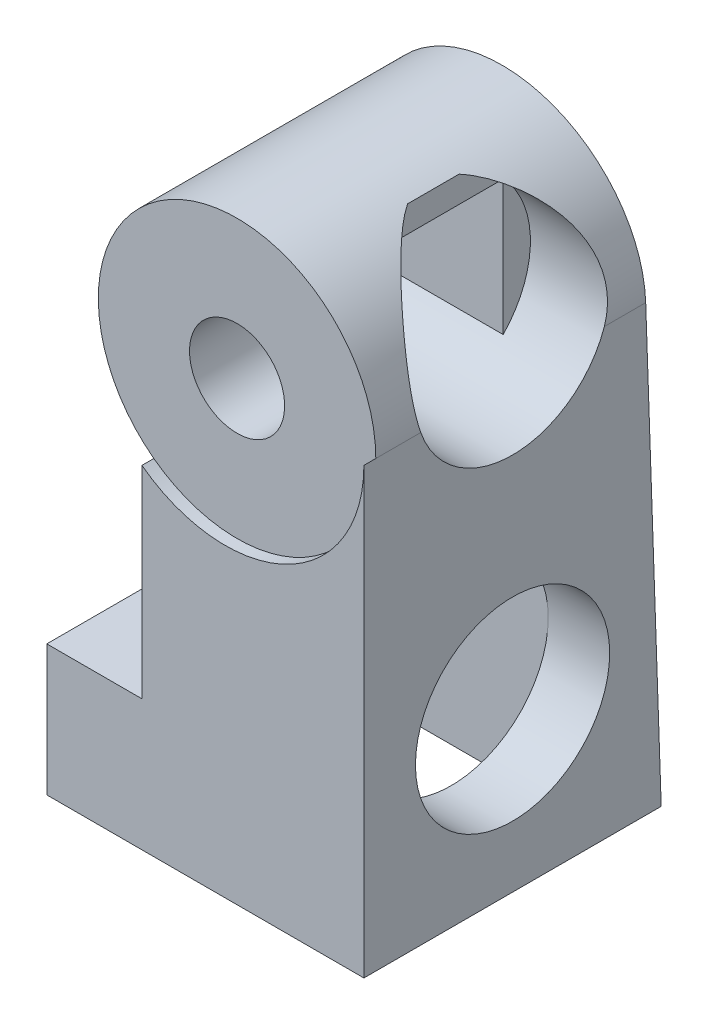
ISO-10303-21;
HEADER;
FILE_DESCRIPTION(('STEP AP214'),'2;1');
FILE_NAME('part.step','',(''),(''),'','','');
FILE_SCHEMA(('AUTOMOTIVE_DESIGN { 1 0 10303 214 1 1 1 1 }'));
ENDSEC;
DATA;
#1=APPLICATION_CONTEXT('core data for automotive mechanical design processes');
#2=APPLICATION_PROTOCOL_DEFINITION('international standard','automotive_design',2000,#1);
#3=PRODUCT_CONTEXT('',#1,'mechanical');
#4=PRODUCT('Part','Part','',(#3));
#5=PRODUCT_RELATED_PRODUCT_CATEGORY('part','',(#4));
#6=PRODUCT_DEFINITION_FORMATION('','',#4);
#7=PRODUCT_DEFINITION_CONTEXT('part definition',#1,'design');
#8=PRODUCT_DEFINITION('design','',#6,#7);
#9=PRODUCT_DEFINITION_SHAPE('','',#8);
#10=(LENGTH_UNIT() NAMED_UNIT(*) SI_UNIT(.MILLI.,.METRE.));
#11=(NAMED_UNIT(*) PLANE_ANGLE_UNIT() SI_UNIT($,.RADIAN.));
#12=(NAMED_UNIT(*) SI_UNIT($,.STERADIAN.) SOLID_ANGLE_UNIT());
#13=UNCERTAINTY_MEASURE_WITH_UNIT(LENGTH_MEASURE(1.E-05),#10,'distance_accuracy_value','');
#14=(GEOMETRIC_REPRESENTATION_CONTEXT(3) GLOBAL_UNCERTAINTY_ASSIGNED_CONTEXT((#13)) GLOBAL_UNIT_ASSIGNED_CONTEXT((#10,
#11,#12)) REPRESENTATION_CONTEXT('',''));
#15=CARTESIAN_POINT('',(0.,0.,0.));
#16=DIRECTION('',(0.,0.,1.));
#17=DIRECTION('',(1.,0.,0.));
#18=AXIS2_PLACEMENT_3D('',#15,#16,#17);
#19=CARTESIAN_POINT('',(6.,12.,-3.75));
#20=DIRECTION('',(1.,0.,0.));
#21=DIRECTION('',(0.,0.,1.));
#22=AXIS2_PLACEMENT_3D('',#19,#20,#21);
#23=PLANE('',#22);
#24=DIRECTION('',(0.,1.,0.));
#25=VECTOR('',#24,1.);
#26=CARTESIAN_POINT('',(6.,13.7,-2.7));
#27=LINE('',#26,#25);
#28=CARTESIAN_POINT('',(6.,9.78640563788213,-2.7));
#29=VERTEX_POINT('',#28);
#30=CARTESIAN_POINT('',(6.,13.7,-2.7));
#31=VERTEX_POINT('',#30);
#32=EDGE_CURVE('E192',#29,#31,#27,.T.);
#33=ORIENTED_EDGE('',*,*,#32,.T.);
#34=DIRECTION('',(0.,0.,-1.));
#35=VECTOR('',#34,1.);
#36=CARTESIAN_POINT('',(6.,13.7,-5.51422787643774));
#37=LINE('',#36,#35);
#38=CARTESIAN_POINT('',(6.,13.7,-5.51422787643774));
#39=VERTEX_POINT('',#38);
#40=EDGE_CURVE('E178',#31,#39,#37,.T.);
#41=ORIENTED_EDGE('',*,*,#40,.T.);
#42=CARTESIAN_POINT('',(6.,12.,-3.75));
#43=DIRECTION('',(-1.,0.,0.));
#44=DIRECTION('',(0.,0.,1.));
#45=AXIS2_PLACEMENT_3D('',#42,#43,#44);
#46=CIRCLE('',#45,2.45);
#47=CARTESIAN_POINT('',(6.,14.3622776601684,-4.39972629334929));
#48=VERTEX_POINT('',#47);
#49=EDGE_CURVE('E198',#48,#39,#46,.T.);
#50=ORIENTED_EDGE('',*,*,#49,.F.);
#51=DIRECTION('',(0.,0.,1.));
#52=VECTOR('',#51,1.);
#53=CARTESIAN_POINT('',(6.,14.3622776601684,-7.5));
#54=LINE('',#53,#52);
#55=CARTESIAN_POINT('',(6.,14.3622776601684,-3.10027370665071));
#56=VERTEX_POINT('',#55);
#57=EDGE_CURVE('E527',#56,#48,#54,.F.);
#58=ORIENTED_EDGE('',*,*,#57,.F.);
#59=EDGE_CURVE('E199',#29,#56,#46,.T.);
#60=ORIENTED_EDGE('',*,*,#59,.F.);
#61=EDGE_LOOP('',(#33,#41,#50,#58,#60));
#62=FACE_BOUND('',#61,.T.);
#63=ADVANCED_FACE('F36',(#62),#23,.T.);
#64=CARTESIAN_POINT('',(0.,0.,0.));
#65=DIRECTION('',(0.,0.,-1.));
#66=DIRECTION('',(1.,0.,0.));
#67=AXIS2_PLACEMENT_3D('',#64,#65,#66);
#68=PLANE('',#67);
#69=CARTESIAN_POINT('',(4.5,11.2,0.));
#70=DIRECTION('',(0.,0.,1.));
#71=DIRECTION('',(1.,0.,0.));
#72=AXIS2_PLACEMENT_3D('',#69,#70,#71);
#73=CIRCLE('',#72,3.5);
#74=CARTESIAN_POINT('',(2.4,8.4,0.));
#75=VERTEX_POINT('',#74);
#76=CARTESIAN_POINT('',(8.,11.2,0.));
#77=VERTEX_POINT('',#76);
#78=EDGE_CURVE('E228',#75,#77,#73,.T.);
#79=ORIENTED_EDGE('',*,*,#78,.F.);
#80=DIRECTION('',(0.,-1.,0.));
#81=VECTOR('',#80,1.);
#82=CARTESIAN_POINT('',(2.4,0.,0.));
#83=LINE('',#82,#81);
#84=CARTESIAN_POINT('',(2.4,3.3,0.));
#85=VERTEX_POINT('',#84);
#86=EDGE_CURVE('E552',#75,#85,#83,.T.);
#87=ORIENTED_EDGE('',*,*,#86,.T.);
#88=DIRECTION('',(-1.,0.,0.));
#89=VECTOR('',#88,1.);
#90=CARTESIAN_POINT('',(0.,3.3,0.));
#91=LINE('',#90,#89);
#92=CARTESIAN_POINT('',(0.,3.3,0.));
#93=VERTEX_POINT('',#92);
#94=EDGE_CURVE('E576',#85,#93,#91,.T.);
#95=ORIENTED_EDGE('',*,*,#94,.T.);
#96=DIRECTION('',(0.,-1.,0.));
#97=VECTOR('',#96,1.);
#98=CARTESIAN_POINT('',(0.,0.,0.));
#99=LINE('',#98,#97);
#100=CARTESIAN_POINT('',(0.,0.,0.));
#101=VERTEX_POINT('',#100);
#102=EDGE_CURVE('E578',#93,#101,#99,.T.);
#103=ORIENTED_EDGE('',*,*,#102,.T.);
#104=DIRECTION('',(1.,0.,0.));
#105=VECTOR('',#104,1.);
#106=CARTESIAN_POINT('',(0.,0.,0.));
#107=LINE('',#106,#105);
#108=CARTESIAN_POINT('',(8.,0.,0.));
#109=VERTEX_POINT('',#108);
#110=EDGE_CURVE('E567',#101,#109,#107,.T.);
#111=ORIENTED_EDGE('',*,*,#110,.T.);
#112=DIRECTION('',(0.,1.,0.));
#113=VECTOR('',#112,1.);
#114=CARTESIAN_POINT('',(8.,0.,0.));
#115=LINE('',#114,#113);
#116=EDGE_CURVE('E550',#109,#77,#115,.T.);
#117=ORIENTED_EDGE('',*,*,#116,.T.);
#118=EDGE_LOOP('',(#79,#87,#95,#103,#111,#117));
#119=FACE_BOUND('',#118,.T.);
#120=ADVANCED_FACE('F290',(#119),#68,.F.);
#121=CARTESIAN_POINT('',(6.45,2.5,-6.2));
#122=DIRECTION('',(1.,0.,0.));
#123=DIRECTION('',(0.,0.,1.));
#124=AXIS2_PLACEMENT_3D('',#121,#122,#123);
#125=PLANE('',#124);
#126=DIRECTION('',(0.,-1.,0.));
#127=VECTOR('',#126,1.);
#128=CARTESIAN_POINT('',(6.45,2.5,-1.3));
#129=LINE('',#128,#127);
#130=CARTESIAN_POINT('',(6.45,8.8,-1.3));
#131=VERTEX_POINT('',#130);
#132=CARTESIAN_POINT('',(6.45,4.,-1.3));
#133=VERTEX_POINT('',#132);
#134=EDGE_CURVE('E611',#131,#133,#129,.T.);
#135=ORIENTED_EDGE('',*,*,#134,.F.);
#136=DIRECTION('',(0.,0.,-1.));
#137=VECTOR('',#136,1.);
#138=CARTESIAN_POINT('',(6.45,8.8,-6.2));
#139=LINE('',#138,#137);
#140=CARTESIAN_POINT('',(6.45,8.8,-6.2));
#141=VERTEX_POINT('',#140);
#142=EDGE_CURVE('E497',#131,#141,#139,.T.);
#143=ORIENTED_EDGE('',*,*,#142,.T.);
#144=DIRECTION('',(0.,-1.,0.));
#145=VECTOR('',#144,1.);
#146=CARTESIAN_POINT('',(6.45,2.5,-6.2));
#147=LINE('',#146,#145);
#148=CARTESIAN_POINT('',(6.45,4.,-6.2));
#149=VERTEX_POINT('',#148);
#150=EDGE_CURVE('E608',#141,#149,#147,.T.);
#151=ORIENTED_EDGE('',*,*,#150,.T.);
#152=CARTESIAN_POINT('',(6.45,4.,-3.75));
#153=DIRECTION('',(-1.,0.,0.));
#154=DIRECTION('',(0.,0.,1.));
#155=AXIS2_PLACEMENT_3D('',#152,#153,#154);
#156=CIRCLE('',#155,2.45);
#157=EDGE_CURVE('E491',#133,#149,#156,.T.);
#158=ORIENTED_EDGE('',*,*,#157,.F.);
#159=EDGE_LOOP('',(#135,#143,#151,#158));
#160=FACE_BOUND('',#159,.T.);
#161=ADVANCED_FACE('F273',(#160),#125,.F.);
#162=CARTESIAN_POINT('',(2.4,0.,-7.5));
#163=DIRECTION('',(1.,0.,0.));
#164=DIRECTION('',(0.,1.,0.));
#165=AXIS2_PLACEMENT_3D('',#162,#163,#164);
#166=PLANE('',#165);
#167=ORIENTED_EDGE('',*,*,#86,.F.);
#168=DIRECTION('',(0.,0.,1.));
#169=VECTOR('',#168,1.);
#170=CARTESIAN_POINT('',(2.4,8.4,-7.5));
#171=LINE('',#170,#169);
#172=CARTESIAN_POINT('',(2.4,8.4,-0.299999999999998));
#173=VERTEX_POINT('',#172);
#174=EDGE_CURVE('E528',#173,#75,#171,.T.);
#175=ORIENTED_EDGE('',*,*,#174,.F.);
#176=CARTESIAN_POINT('',(2.4,8.4,-7.20666553626932));
#177=VERTEX_POINT('',#176);
#178=EDGE_CURVE('E524',#177,#173,#171,.T.);
#179=ORIENTED_EDGE('',*,*,#178,.F.);
#180=DIRECTION('',(0.,-0.999390827019096,-0.034899496702501));
#181=VECTOR('',#180,1.);
#182=CARTESIAN_POINT('',(2.4,0.,-7.5));
#183=LINE('',#182,#181);
#184=CARTESIAN_POINT('',(2.4,3.3,-7.38476146067723));
#185=VERTEX_POINT('',#184);
#186=EDGE_CURVE('E547',#177,#185,#183,.T.);
#187=ORIENTED_EDGE('',*,*,#186,.T.);
#188=DIRECTION('',(0.,0.,1.));
#189=VECTOR('',#188,1.);
#190=CARTESIAN_POINT('',(2.4,3.3,-7.5));
#191=LINE('',#190,#189);
#192=EDGE_CURVE('E572',#185,#85,#191,.T.);
#193=ORIENTED_EDGE('',*,*,#192,.T.);
#194=EDGE_LOOP('',(#167,#175,#179,#187,#193));
#195=FACE_BOUND('',#194,.T.);
#196=ADVANCED_FACE('F268',(#195),#166,.F.);
#197=CARTESIAN_POINT('',(0.,3.3,-7.5));
#198=DIRECTION('',(0.,-1.,0.));
#199=DIRECTION('',(1.,0.,0.));
#200=AXIS2_PLACEMENT_3D('',#197,#198,#199);
#201=PLANE('',#200);
#202=ORIENTED_EDGE('',*,*,#94,.F.);
#203=ORIENTED_EDGE('',*,*,#192,.F.);
#204=DIRECTION('',(-1.,0.,0.));
#205=VECTOR('',#204,1.);
#206=CARTESIAN_POINT('',(0.,3.3,-7.38476146067723));
#207=LINE('',#206,#205);
#208=CARTESIAN_POINT('',(0.,3.3,-7.38476146067723));
#209=VERTEX_POINT('',#208);
#210=EDGE_CURVE('E544',#185,#209,#207,.T.);
#211=ORIENTED_EDGE('',*,*,#210,.T.);
#212=DIRECTION('',(0.,0.,1.));
#213=VECTOR('',#212,1.);
#214=CARTESIAN_POINT('',(0.,3.3,-7.5));
#215=LINE('',#214,#213);
#216=EDGE_CURVE('E589',#209,#93,#215,.T.);
#217=ORIENTED_EDGE('',*,*,#216,.T.);
#218=EDGE_LOOP('',(#202,#203,#211,#217));
#219=FACE_BOUND('',#218,.T.);
#220=ADVANCED_FACE('F272',(#219),#201,.F.);
#221=CARTESIAN_POINT('',(0.,0.,-7.5));
#222=DIRECTION('',(1.,0.,0.));
#223=DIRECTION('',(0.,0.,1.));
#224=AXIS2_PLACEMENT_3D('',#221,#222,#223);
#225=PLANE('',#224);
#226=ORIENTED_EDGE('',*,*,#102,.F.);
#227=ORIENTED_EDGE('',*,*,#216,.F.);
#228=DIRECTION('',(0.,-0.999390827019096,-0.034899496702501));
#229=VECTOR('',#228,1.);
#230=CARTESIAN_POINT('',(0.,0.,-7.5));
#231=LINE('',#230,#229);
#232=CARTESIAN_POINT('',(0.,0.,-7.5));
#233=VERTEX_POINT('',#232);
#234=EDGE_CURVE('E541',#209,#233,#231,.T.);
#235=ORIENTED_EDGE('',*,*,#234,.T.);
#236=DIRECTION('',(0.,0.,1.));
#237=VECTOR('',#236,1.);
#238=CARTESIAN_POINT('',(0.,0.,-7.5));
#239=LINE('',#238,#237);
#240=EDGE_CURVE('E587',#233,#101,#239,.T.);
#241=ORIENTED_EDGE('',*,*,#240,.T.);
#242=EDGE_LOOP('',(#226,#227,#235,#241));
#243=FACE_BOUND('',#242,.T.);
#244=ADVANCED_FACE('F277',(#243),#225,.F.);
#245=CARTESIAN_POINT('',(0.,0.,-7.5));
#246=DIRECTION('',(0.,1.,0.));
#247=DIRECTION('',(0.,0.,-1.));
#248=AXIS2_PLACEMENT_3D('',#245,#246,#247);
#249=PLANE('',#248);
#250=DIRECTION('',(1.,0.,0.));
#251=VECTOR('',#250,1.);
#252=CARTESIAN_POINT('',(1.55,0.,-1.3));
#253=LINE('',#252,#251);
#254=CARTESIAN_POINT('',(1.55,0.,-1.3));
#255=VERTEX_POINT('',#254);
#256=CARTESIAN_POINT('',(6.45,0.,-1.3));
#257=VERTEX_POINT('',#256);
#258=EDGE_CURVE('E598',#255,#257,#253,.T.);
#259=ORIENTED_EDGE('',*,*,#258,.T.);
#260=DIRECTION('',(0.,0.,-1.));
#261=VECTOR('',#260,1.);
#262=CARTESIAN_POINT('',(6.45,0.,-6.2));
#263=LINE('',#262,#261);
#264=CARTESIAN_POINT('',(6.45,0.,-6.2));
#265=VERTEX_POINT('',#264);
#266=EDGE_CURVE('E601',#257,#265,#263,.T.);
#267=ORIENTED_EDGE('',*,*,#266,.T.);
#268=DIRECTION('',(-1.,0.,0.));
#269=VECTOR('',#268,1.);
#270=CARTESIAN_POINT('',(1.55,0.,-6.2));
#271=LINE('',#270,#269);
#272=CARTESIAN_POINT('',(1.55,0.,-6.2));
#273=VERTEX_POINT('',#272);
#274=EDGE_CURVE('E604',#265,#273,#271,.T.);
#275=ORIENTED_EDGE('',*,*,#274,.T.);
#276=DIRECTION('',(0.,0.,1.));
#277=VECTOR('',#276,1.);
#278=CARTESIAN_POINT('',(1.55,0.,-6.2));
#279=LINE('',#278,#277);
#280=EDGE_CURVE('E517',#273,#255,#279,.T.);
#281=ORIENTED_EDGE('',*,*,#280,.T.);
#282=EDGE_LOOP('',(#259,#267,#275,#281));
#283=FACE_BOUND('',#282,.T.);
#284=ORIENTED_EDGE('',*,*,#110,.F.);
#285=ORIENTED_EDGE('',*,*,#240,.F.);
#286=DIRECTION('',(1.,0.,0.));
#287=VECTOR('',#286,1.);
#288=CARTESIAN_POINT('',(0.,0.,-7.5));
#289=LINE('',#288,#287);
#290=CARTESIAN_POINT('',(8.,0.,-7.5));
#291=VERTEX_POINT('',#290);
#292=EDGE_CURVE('E538',#233,#291,#289,.T.);
#293=ORIENTED_EDGE('',*,*,#292,.T.);
#294=DIRECTION('',(0.,0.,1.));
#295=VECTOR('',#294,1.);
#296=CARTESIAN_POINT('',(8.,0.,-7.5));
#297=LINE('',#296,#295);
#298=EDGE_CURVE('E532',#291,#109,#297,.T.);
#299=ORIENTED_EDGE('',*,*,#298,.T.);
#300=EDGE_LOOP('',(#284,#285,#293,#299));
#301=FACE_BOUND('',#300,.T.);
#302=ADVANCED_FACE('F281',(#283,#301),#249,.F.);
#303=CARTESIAN_POINT('',(8.,0.,-7.5));
#304=DIRECTION('',(-1.,0.,0.));
#305=DIRECTION('',(0.,0.,-1.));
#306=AXIS2_PLACEMENT_3D('',#303,#304,#305);
#307=PLANE('',#306);
#308=CARTESIAN_POINT('',(8.,4.,-3.75));
#309=DIRECTION('',(-1.,0.,0.));
#310=DIRECTION('',(0.,0.,1.));
#311=AXIS2_PLACEMENT_3D('',#308,#309,#310);
#312=CIRCLE('',#311,2.45);
#313=CARTESIAN_POINT('',(8.,4.,-1.3));
#314=VERTEX_POINT('',#313);
#315=EDGE_CURVE('E207',#314,#314,#312,.T.);
#316=ORIENTED_EDGE('',*,*,#315,.T.);
#317=EDGE_LOOP('',(#316));
#318=FACE_BOUND('',#317,.T.);
#319=DIRECTION('',(0.,0.,1.));
#320=VECTOR('',#319,1.);
#321=CARTESIAN_POINT('',(8.,11.2,-7.5));
#322=LINE('',#321,#320);
#323=CARTESIAN_POINT('',(8.,11.2,-1.43429276461812));
#324=VERTEX_POINT('',#323);
#325=CARTESIAN_POINT('',(8.,11.2,-0.299999999999998));
#326=VERTEX_POINT('',#325);
#327=EDGE_CURVE('E533',#324,#326,#322,.T.);
#328=ORIENTED_EDGE('',*,*,#327,.T.);
#329=EDGE_CURVE('E534',#326,#77,#322,.T.);
#330=ORIENTED_EDGE('',*,*,#329,.T.);
#331=ORIENTED_EDGE('',*,*,#116,.F.);
#332=ORIENTED_EDGE('',*,*,#298,.F.);
#333=DIRECTION('',(0.,0.999390827019096,0.034899496702501));
#334=VECTOR('',#333,1.);
#335=CARTESIAN_POINT('',(8.,0.,-7.5));
#336=LINE('',#335,#334);
#337=CARTESIAN_POINT('',(8.,11.2,-7.10888738169242));
#338=VERTEX_POINT('',#337);
#339=EDGE_CURVE('E535',#291,#338,#336,.T.);
#340=ORIENTED_EDGE('',*,*,#339,.T.);
#341=CARTESIAN_POINT('',(8.,11.2,-6.06570723538188));
#342=VERTEX_POINT('',#341);
#343=EDGE_CURVE('E529',#338,#342,#322,.T.);
#344=ORIENTED_EDGE('',*,*,#343,.T.);
#345=CARTESIAN_POINT('',(8.,12.,-3.75));
#346=DIRECTION('',(-1.,0.,0.));
#347=DIRECTION('',(0.,0.,1.));
#348=AXIS2_PLACEMENT_3D('',#345,#346,#347);
#349=CIRCLE('',#348,2.45);
#350=EDGE_CURVE('E482',#342,#324,#349,.T.);
#351=ORIENTED_EDGE('',*,*,#350,.T.);
#352=EDGE_LOOP('',(#328,#330,#331,#332,#340,#344,#351));
#353=FACE_BOUND('',#352,.T.);
#354=ADVANCED_FACE('F285',(#318,#353),#307,.F.);
#355=CARTESIAN_POINT('',(0.,0.,-7.5));
#356=DIRECTION('',(0.,0.034899496702501,-0.999390827019096));
#357=DIRECTION('',(0.,-0.999390827019096,-0.034899496702501));
#358=AXIS2_PLACEMENT_3D('',#355,#356,#357);
#359=PLANE('',#358);
#360=ORIENTED_EDGE('',*,*,#339,.F.);
#361=ORIENTED_EDGE('',*,*,#292,.F.);
#362=ORIENTED_EDGE('',*,*,#234,.F.);
#363=ORIENTED_EDGE('',*,*,#210,.F.);
#364=ORIENTED_EDGE('',*,*,#186,.F.);
#365=CARTESIAN_POINT('',(4.5,11.2,-7.10888738169242));
#366=DIRECTION('',(0.,-0.034899496702501,0.999390827019096));
#367=DIRECTION('',(0.,0.999390827019096,0.034899496702501));
#368=AXIS2_PLACEMENT_3D('',#365,#366,#367);
#369=ELLIPSE('',#368,3.50213340504588,3.5);
#370=EDGE_CURVE('E551',#338,#177,#369,.T.);
#371=ORIENTED_EDGE('',*,*,#370,.F.);
#372=EDGE_LOOP('',(#360,#361,#362,#363,#364,#371));
#373=FACE_BOUND('',#372,.T.);
#374=ADVANCED_FACE('F38',(#373),#359,.T.);
#375=CARTESIAN_POINT('',(4.5,11.2,-7.5));
#376=DIRECTION('',(0.,0.,1.));
#377=DIRECTION('',(-1.,0.,0.));
#378=AXIS2_PLACEMENT_3D('',#375,#376,#377);
#379=CYLINDRICAL_SURFACE('',#378,3.5);
#380=ORIENTED_EDGE('',*,*,#327,.F.);
#381=CARTESIAN_POINT('',(6.,14.3622776601684,-3.10027370665071));
#382=CARTESIAN_POINT('',(6.02565340789794,14.3501187814284,-3.0561129168611));
#383=CARTESIAN_POINT('',(6.05259341984377,14.3369490446843,-3.01302812850763));
#384=CARTESIAN_POINT('',(6.10837800504377,14.3087102229337,-2.92881592970245));
#385=CARTESIAN_POINT('',(6.1372206174035,14.2936430793437,-2.88768657688925));
#386=CARTESIAN_POINT('',(6.1961383208396,14.2617381574981,-2.80718134697281));
#387=CARTESIAN_POINT('',(6.22621087103671,14.2449039271733,-2.76780217400536));
#388=CARTESIAN_POINT('',(6.28724197720783,14.209486966541,-2.69053140566553));
#389=CARTESIAN_POINT('',(6.31820079168116,14.1909037224023,-2.65264025211125));
#390=CARTESIAN_POINT('',(6.41218538545477,14.1324049495322,-2.54067232258956));
#391=CARTESIAN_POINT('',(6.476056395877,14.0898800098068,-2.46864959622902));
#392=CARTESIAN_POINT('',(6.60424652029414,13.9979252020629,-2.32952721506645));
#393=CARTESIAN_POINT('',(6.66856585217075,13.9484917165048,-2.26243016776908));
#394=CARTESIAN_POINT('',(6.78880568564041,13.8489090914714,-2.14082212998378));
#395=CARTESIAN_POINT('',(6.84481740360096,13.7995404695367,-2.08576230094961));
#396=CARTESIAN_POINT('',(6.95547730273101,13.6952775586961,-1.9796712110384));
#397=CARTESIAN_POINT('',(7.01012579485157,13.6403845445518,-1.92863902560378));
#398=CARTESIAN_POINT('',(7.11728992076444,13.525075360515,-1.83105836403579));
#399=CARTESIAN_POINT('',(7.16980940457081,13.4646698674935,-1.784501564524));
#400=CARTESIAN_POINT('',(7.27210952373784,13.3382289932313,-1.69632464250168));
#401=CARTESIAN_POINT('',(7.32189075398967,13.2721948428397,-1.65470344543221));
#402=CARTESIAN_POINT('',(7.44246575147188,13.0994560587039,-1.55730283463763));
#403=CARTESIAN_POINT('',(7.51107500554515,12.9891427073396,-1.50508352733528));
#404=CARTESIAN_POINT('',(7.63761066742282,12.7565507337796,-1.41642823989336));
#405=CARTESIAN_POINT('',(7.69554518713992,12.6342813062737,-1.37998024622393));
#406=CARTESIAN_POINT('',(7.77251685846022,12.4431607801845,-1.33951721126887));
#407=CARTESIAN_POINT('',(7.79662457585845,12.3777834981923,-1.32837620971132));
#408=CARTESIAN_POINT('',(7.84105507083502,12.2450995217627,-1.3113751596333));
#409=CARTESIAN_POINT('',(7.86137990786358,12.1777939003065,-1.30551223094969));
#410=CARTESIAN_POINT('',(7.89796872068918,12.0418780809203,-1.29941430450083));
#411=CARTESIAN_POINT('',(7.91423537814343,11.9732687769019,-1.29917558044607));
#412=CARTESIAN_POINT('',(7.94255075721787,11.8354483316535,-1.30455942939617));
#413=CARTESIAN_POINT('',(7.95460129145753,11.7662374622003,-1.31017947941788));
#414=CARTESIAN_POINT('',(7.97656824197193,11.6131026974145,-1.32926507469877));
#415=CARTESIAN_POINT('',(7.98547562572354,11.5292007465003,-1.34415252699801));
#416=CARTESIAN_POINT('',(7.99426394727624,11.4046049548488,-1.37306267477184));
#417=CARTESIAN_POINT('',(7.99643121890712,11.3632681700207,-1.38380084141635));
#418=CARTESIAN_POINT('',(7.99929965141643,11.2811691231353,-1.40743607810964));
#419=CARTESIAN_POINT('',(8.00000096247472,11.2404068026521,-1.42033292686671));
#420=CARTESIAN_POINT('',(8.,11.2,-1.43429276461812));
#421=B_SPLINE_CURVE_WITH_KNOTS('',3,(#381,#382,#383,#384,#385,#386,#387,#388,#389,#390,#391,
#392,#393,#394,#395,#396,#397,#398,#399,#400,#401,#402,#403,#404,#405,#406,#407,#408,#409,#410,
#411,#412,#413,#414,#415,#416,#417,#418,#419,#420),.UNSPECIFIED.,.F.,.F.,(4,2,2,2,2,2,2,2,2,2,2,
2,2,2,2,2,2,2,2,4),(0.,0.157398635044291,0.314637509636125,0.47156651140427,0.628541761082652,
0.943862465700609,1.25934890550389,1.53741075389402,1.81540858557553,2.09287896291623,
2.37028881921098,2.78873669963868,3.20686527098015,3.41828746076653,3.62959421066328,
3.840760956358,4.05183680417219,4.308096342826,4.43631671215153,4.56452394533867),.UNSPECIFIED.);
#422=EDGE_CURVE('E45',#56,#324,#421,.T.);
#423=ORIENTED_EDGE('',*,*,#422,.F.);
#424=ORIENTED_EDGE('',*,*,#57,.T.);
#425=CARTESIAN_POINT('',(8.,11.2,-6.06570723538188));
#426=CARTESIAN_POINT('',(8.00001066419281,11.2555859724596,-6.08492172629228));
#427=CARTESIAN_POINT('',(7.99867598743207,11.311873301131,-6.10211542368775));
#428=CARTESIAN_POINT('',(7.9931938501136,11.4254042985271,-6.13238900039132));
#429=CARTESIAN_POINT('',(7.9890465825867,11.4826479013588,-6.14546916192522));
#430=CARTESIAN_POINT('',(7.97784264718591,11.5973921776251,-6.16739628392097));
#431=CARTESIAN_POINT('',(7.97079925227553,11.6548905096612,-6.17626216391976));
#432=CARTESIAN_POINT('',(7.95377716670013,11.7699223596169,-6.18986152585257));
#433=CARTESIAN_POINT('',(7.94379862460003,11.8274558756085,-6.19459521689267));
#434=CARTESIAN_POINT('',(7.90946339606441,11.9994840631924,-6.20267975119494));
#435=CARTESIAN_POINT('',(7.88070114926205,12.113468482753,-6.19992566014156));
#436=CARTESIAN_POINT('',(7.81235121743177,12.3366656803489,-6.17935495230665));
#437=CARTESIAN_POINT('',(7.77275635647266,12.4458752395209,-6.16152833449447));
#438=CARTESIAN_POINT('',(7.68269293715746,12.6610030630074,-6.11181794869455));
#439=CARTESIAN_POINT('',(7.6318912218797,12.7666708879899,-6.07946230786302));
#440=CARTESIAN_POINT('',(7.52222678639467,12.9690196822273,-6.00282732321686));
#441=CARTESIAN_POINT('',(7.46336084462865,13.0656970338553,-5.95854320725778));
#442=CARTESIAN_POINT('',(7.30705643544795,13.2973284244922,-5.8343644022297));
#443=CARTESIAN_POINT('',(7.20547832522688,13.4260428059191,-5.7479269721117));
#444=CARTESIAN_POINT('',(7.04660840941317,13.6023148393344,-5.60495369158686));
#445=CARTESIAN_POINT('',(6.99243340246129,13.6583837250561,-5.5549435311814));
#446=CARTESIAN_POINT('',(6.88258005771902,13.7649860379074,-5.45084303835125));
#447=CARTESIAN_POINT('',(6.82690226491794,13.8155214390236,-5.39675417264685));
#448=CARTESIAN_POINT('',(6.71338315000754,13.912312245943,-5.2833809641533));
#449=CARTESIAN_POINT('',(6.65552219505235,13.9584330243329,-5.22400201287864));
#450=CARTESIAN_POINT('',(6.53983908198178,14.045043019041,-5.10127312013026));
#451=CARTESIAN_POINT('',(6.48201691736452,14.0855340885884,-5.03792449543251));
#452=CARTESIAN_POINT('',(6.3677930209355,14.1607436625587,-4.9073005132432));
#453=CARTESIAN_POINT('',(6.31138592510411,14.1954881905756,-4.84004483226411));
#454=CARTESIAN_POINT('',(6.20138967305511,14.2592956748146,-4.70076400227527));
#455=CARTESIAN_POINT('',(6.14779699436374,14.288365863109,-4.62874508303236));
#456=CARTESIAN_POINT('',(6.08012598136603,14.3230703280027,-4.52880586101317));
#457=CARTESIAN_POINT('',(6.06353299620449,14.3314040111069,-4.5035099689439));
#458=CARTESIAN_POINT('',(6.03113223920953,14.3473735036815,-4.45218263850551));
#459=CARTESIAN_POINT('',(6.01532496613916,14.355008872387,-4.42615074897101));
#460=CARTESIAN_POINT('',(6.,14.3622776601684,-4.39972629334929));
#461=B_SPLINE_CURVE_WITH_KNOTS('',3,(#425,#426,#427,#428,#429,#430,#431,#432,#433,#434,#435,
#436,#437,#438,#439,#440,#441,#442,#443,#444,#445,#446,#447,#448,#449,#450,#451,#452,#453,#454,
#455,#456,#457,#458,#459,#460),.UNSPECIFIED.,.F.,.F.,(4,2,2,2,2,2,2,2,2,2,2,2,2,2,2,2,2,4),(0.,
0.176389244501176,0.352766384462628,0.52834404076466,0.703912811586333,1.05486249179244,
1.40604521954879,1.76956623862622,2.13323290565664,2.68601779787751,2.9637141711236,
3.24131115543474,3.52568598146468,3.80996697210936,4.09292306958182,4.37551614408389,
4.46963180188713,4.56380645982924),.UNSPECIFIED.);
#462=EDGE_CURVE('E12',#342,#48,#461,.T.);
#463=ORIENTED_EDGE('',*,*,#462,.F.);
#464=ORIENTED_EDGE('',*,*,#343,.F.);
#465=ORIENTED_EDGE('',*,*,#370,.T.);
#466=ORIENTED_EDGE('',*,*,#178,.T.);
#467=CARTESIAN_POINT('',(4.5,11.2,-0.299999999999998));
#468=DIRECTION('',(0.,0.,1.));
#469=DIRECTION('',(1.,0.,0.));
#470=AXIS2_PLACEMENT_3D('',#467,#468,#469);
#471=CIRCLE('',#470,3.5);
#472=EDGE_CURVE('E480',#326,#173,#471,.T.);
#473=ORIENTED_EDGE('',*,*,#472,.F.);
#474=EDGE_LOOP('',(#380,#423,#424,#463,#464,#465,#466,#473));
#475=FACE_BOUND('',#474,.T.);
#476=ADVANCED_FACE('F262',(#475),#379,.T.);
#477=CARTESIAN_POINT('',(1.55,2.5,-6.2));
#478=DIRECTION('',(-1.,0.,0.));
#479=DIRECTION('',(0.,0.,-1.));
#480=AXIS2_PLACEMENT_3D('',#477,#478,#479);
#481=PLANE('',#480);
#482=ORIENTED_EDGE('',*,*,#280,.F.);
#483=DIRECTION('',(0.,-1.,0.));
#484=VECTOR('',#483,1.);
#485=CARTESIAN_POINT('',(1.55,2.5,-6.2));
#486=LINE('',#485,#484);
#487=CARTESIAN_POINT('',(1.55,2.5,-6.2));
#488=VERTEX_POINT('',#487);
#489=EDGE_CURVE('E553',#488,#273,#486,.T.);
#490=ORIENTED_EDGE('',*,*,#489,.F.);
#491=DIRECTION('',(0.,0.,1.));
#492=VECTOR('',#491,1.);
#493=CARTESIAN_POINT('',(1.55,2.5,-6.2));
#494=LINE('',#493,#492);
#495=CARTESIAN_POINT('',(1.55,2.5,-1.3));
#496=VERTEX_POINT('',#495);
#497=EDGE_CURVE('E506',#488,#496,#494,.T.);
#498=ORIENTED_EDGE('',*,*,#497,.T.);
#499=DIRECTION('',(0.,-1.,0.));
#500=VECTOR('',#499,1.);
#501=CARTESIAN_POINT('',(1.55,2.5,-1.3));
#502=LINE('',#501,#500);
#503=EDGE_CURVE('E581',#496,#255,#502,.T.);
#504=ORIENTED_EDGE('',*,*,#503,.T.);
#505=EDGE_LOOP('',(#482,#490,#498,#504));
#506=FACE_BOUND('',#505,.T.);
#507=ADVANCED_FACE('F266',(#506),#481,.F.);
#508=CARTESIAN_POINT('',(1.55,2.5,-6.2));
#509=DIRECTION('',(0.,0.,-1.));
#510=DIRECTION('',(1.,0.,0.));
#511=AXIS2_PLACEMENT_3D('',#508,#509,#510);
#512=PLANE('',#511);
#513=ORIENTED_EDGE('',*,*,#150,.F.);
#514=DIRECTION('',(-1.,0.,0.));
#515=VECTOR('',#514,1.);
#516=CARTESIAN_POINT('',(3.45,8.8,-6.2));
#517=LINE('',#516,#515);
#518=CARTESIAN_POINT('',(3.45,8.8,-6.2));
#519=VERTEX_POINT('',#518);
#520=EDGE_CURVE('E500',#141,#519,#517,.T.);
#521=ORIENTED_EDGE('',*,*,#520,.T.);
#522=DIRECTION('',(0.,-1.,0.));
#523=VECTOR('',#522,1.);
#524=CARTESIAN_POINT('',(3.45,8.8,-6.2));
#525=LINE('',#524,#523);
#526=CARTESIAN_POINT('',(3.45,2.5,-6.2));
#527=VERTEX_POINT('',#526);
#528=EDGE_CURVE('E514',#519,#527,#525,.T.);
#529=ORIENTED_EDGE('',*,*,#528,.T.);
#530=DIRECTION('',(-1.,0.,0.));
#531=VECTOR('',#530,1.);
#532=CARTESIAN_POINT('',(1.55,2.5,-6.2));
#533=LINE('',#532,#531);
#534=EDGE_CURVE('E511',#527,#488,#533,.T.);
#535=ORIENTED_EDGE('',*,*,#534,.T.);
#536=ORIENTED_EDGE('',*,*,#489,.T.);
#537=ORIENTED_EDGE('',*,*,#274,.F.);
#538=EDGE_CURVE('E610',#149,#265,#147,.T.);
#539=ORIENTED_EDGE('',*,*,#538,.F.);
#540=EDGE_LOOP('',(#513,#521,#529,#535,#536,#537,#539));
#541=FACE_BOUND('',#540,.T.);
#542=ADVANCED_FACE('F296',(#541),#512,.F.);
#543=ORIENTED_EDGE('',*,*,#538,.T.);
#544=ORIENTED_EDGE('',*,*,#266,.F.);
#545=EDGE_CURVE('E613',#133,#257,#129,.T.);
#546=ORIENTED_EDGE('',*,*,#545,.F.);
#547=EDGE_CURVE('E489',#149,#133,#156,.T.);
#548=ORIENTED_EDGE('',*,*,#547,.F.);
#549=EDGE_LOOP('',(#543,#544,#546,#548));
#550=FACE_BOUND('',#549,.T.);
#551=ADVANCED_FACE('F302',(#550),#125,.F.);
#552=CARTESIAN_POINT('',(1.55,2.5,-1.3));
#553=DIRECTION('',(0.,0.,1.));
#554=DIRECTION('',(-1.,0.,0.));
#555=AXIS2_PLACEMENT_3D('',#552,#553,#554);
#556=PLANE('',#555);
#557=ORIENTED_EDGE('',*,*,#545,.T.);
#558=ORIENTED_EDGE('',*,*,#258,.F.);
#559=ORIENTED_EDGE('',*,*,#503,.F.);
#560=DIRECTION('',(1.,0.,0.));
#561=VECTOR('',#560,1.);
#562=CARTESIAN_POINT('',(1.55,2.5,-1.3));
#563=LINE('',#562,#561);
#564=CARTESIAN_POINT('',(3.45,2.5,-1.3));
#565=VERTEX_POINT('',#564);
#566=EDGE_CURVE('E591',#496,#565,#563,.T.);
#567=ORIENTED_EDGE('',*,*,#566,.T.);
#568=DIRECTION('',(0.,-1.,0.));
#569=VECTOR('',#568,1.);
#570=CARTESIAN_POINT('',(3.45,8.8,-1.3));
#571=LINE('',#570,#569);
#572=CARTESIAN_POINT('',(3.45,8.8,-1.3));
#573=VERTEX_POINT('',#572);
#574=EDGE_CURVE('E503',#573,#565,#571,.T.);
#575=ORIENTED_EDGE('',*,*,#574,.F.);
#576=DIRECTION('',(1.,0.,0.));
#577=VECTOR('',#576,1.);
#578=CARTESIAN_POINT('',(3.45,8.8,-1.3));
#579=LINE('',#578,#577);
#580=EDGE_CURVE('E494',#573,#131,#579,.T.);
#581=ORIENTED_EDGE('',*,*,#580,.T.);
#582=ORIENTED_EDGE('',*,*,#134,.T.);
#583=EDGE_LOOP('',(#557,#558,#559,#567,#575,#581,#582));
#584=FACE_BOUND('',#583,.T.);
#585=ADVANCED_FACE('F298',(#584),#556,.F.);
#586=CARTESIAN_POINT('',(0.,2.5,0.));
#587=DIRECTION('',(0.,-1.,0.));
#588=DIRECTION('',(0.,0.,1.));
#589=AXIS2_PLACEMENT_3D('',#586,#587,#588);
#590=PLANE('',#589);
#591=DIRECTION('',(0.,0.,1.));
#592=VECTOR('',#591,1.);
#593=CARTESIAN_POINT('',(3.45,2.5,-6.2));
#594=LINE('',#593,#592);
#595=EDGE_CURVE('E495',#527,#565,#594,.T.);
#596=ORIENTED_EDGE('',*,*,#595,.T.);
#597=ORIENTED_EDGE('',*,*,#566,.F.);
#598=ORIENTED_EDGE('',*,*,#497,.F.);
#599=ORIENTED_EDGE('',*,*,#534,.F.);
#600=EDGE_LOOP('',(#596,#597,#598,#599));
#601=FACE_BOUND('',#600,.T.);
#602=ADVANCED_FACE('F301',(#601),#590,.T.);
#603=CARTESIAN_POINT('',(3.45,8.8,-6.2));
#604=DIRECTION('',(-1.,0.,0.));
#605=DIRECTION('',(0.,0.,-1.));
#606=AXIS2_PLACEMENT_3D('',#603,#604,#605);
#607=PLANE('',#606);
#608=ORIENTED_EDGE('',*,*,#595,.F.);
#609=ORIENTED_EDGE('',*,*,#528,.F.);
#610=DIRECTION('',(0.,0.,1.));
#611=VECTOR('',#610,1.);
#612=CARTESIAN_POINT('',(3.45,8.8,-6.2));
#613=LINE('',#612,#611);
#614=EDGE_CURVE('E492',#519,#573,#613,.T.);
#615=ORIENTED_EDGE('',*,*,#614,.T.);
#616=ORIENTED_EDGE('',*,*,#574,.T.);
#617=EDGE_LOOP('',(#608,#609,#615,#616));
#618=FACE_BOUND('',#617,.T.);
#619=ADVANCED_FACE('F312',(#618),#607,.F.);
#620=CARTESIAN_POINT('',(0.,8.8,0.));
#621=DIRECTION('',(0.,-1.,0.));
#622=DIRECTION('',(0.,0.,1.));
#623=AXIS2_PLACEMENT_3D('',#620,#621,#622);
#624=PLANE('',#623);
#625=ORIENTED_EDGE('',*,*,#614,.F.);
#626=ORIENTED_EDGE('',*,*,#520,.F.);
#627=ORIENTED_EDGE('',*,*,#142,.F.);
#628=ORIENTED_EDGE('',*,*,#580,.F.);
#629=EDGE_LOOP('',(#625,#626,#627,#628));
#630=FACE_BOUND('',#629,.T.);
#631=ADVANCED_FACE('F315',(#630),#624,.T.);
#632=CARTESIAN_POINT('',(6.,4.,-3.75));
#633=DIRECTION('',(1.,0.,0.));
#634=DIRECTION('',(0.,0.,1.));
#635=AXIS2_PLACEMENT_3D('',#632,#633,#634);
#636=CYLINDRICAL_SURFACE('',#635,2.45);
#637=ORIENTED_EDGE('',*,*,#315,.F.);
#638=EDGE_LOOP('',(#637));
#639=FACE_BOUND('',#638,.T.);
#640=ORIENTED_EDGE('',*,*,#547,.T.);
#641=ORIENTED_EDGE('',*,*,#157,.T.);
#642=EDGE_LOOP('',(#640,#641));
#643=FACE_BOUND('',#642,.T.);
#644=ADVANCED_FACE('F251',(#639,#643),#636,.F.);
#645=CARTESIAN_POINT('',(6.,12.,-3.75));
#646=DIRECTION('',(1.,0.,0.));
#647=DIRECTION('',(0.,0.,1.));
#648=AXIS2_PLACEMENT_3D('',#645,#646,#647);
#649=CYLINDRICAL_SURFACE('',#648,2.45);
#650=ORIENTED_EDGE('',*,*,#350,.F.);
#651=ORIENTED_EDGE('',*,*,#462,.T.);
#652=ORIENTED_EDGE('',*,*,#49,.T.);
#653=CARTESIAN_POINT('',(6.,10.3,-5.51422787643774));
#654=VERTEX_POINT('',#653);
#655=EDGE_CURVE('E194',#39,#654,#46,.T.);
#656=ORIENTED_EDGE('',*,*,#655,.T.);
#657=DIRECTION('',(1.,0.,0.));
#658=VECTOR('',#657,1.);
#659=CARTESIAN_POINT('',(-2.001,10.3,-5.51422787643774));
#660=LINE('',#659,#658);
#661=CARTESIAN_POINT('',(2.16761924206188,10.3,-5.51422787643774));
#662=VERTEX_POINT('',#661);
#663=EDGE_CURVE('E189',#662,#654,#660,.T.);
#664=ORIENTED_EDGE('',*,*,#663,.F.);
#665=CARTESIAN_POINT('',(2.43802255604273,9.78640563788213,-2.7));
#666=CARTESIAN_POINT('',(2.45439781461528,9.76251741877759,-2.75037503476577));
#667=CARTESIAN_POINT('',(2.47025500879551,9.74027881845354,-2.8016875263454));
#668=CARTESIAN_POINT('',(2.50042760848287,9.69921422684821,-2.90616952588401));
#669=CARTESIAN_POINT('',(2.51474122383696,9.68039218097329,-2.95934109728092));
#670=CARTESIAN_POINT('',(2.55465226885188,9.62916812111359,-3.12185322868328));
#671=CARTESIAN_POINT('',(2.57708659704231,9.60219307969136,-3.23380488428258));
#672=CARTESIAN_POINT('',(2.60939773327412,9.56406314117034,-3.46312510454168));
#673=CARTESIAN_POINT('',(2.61917847762832,9.55302919309986,-3.58052817828893));
#674=CARTESIAN_POINT('',(2.62352592827918,9.54807254332745,-3.81556736586228));
#675=CARTESIAN_POINT('',(2.61815119187259,9.55408398266473,-3.93320083263776));
#676=CARTESIAN_POINT('',(2.59493025937629,9.58106372937509,-4.15276003298698));
#677=CARTESIAN_POINT('',(2.57844102888516,9.60040935523592,-4.25504588449916));
#678=CARTESIAN_POINT('',(2.53715183499253,9.65135603399639,-4.45502362935958));
#679=CARTESIAN_POINT('',(2.51232561823557,9.68299585165166,-4.55269988469709));
#680=CARTESIAN_POINT('',(2.44651912480812,9.77261902414771,-4.78040576355963));
#681=CARTESIAN_POINT('',(2.40306529527959,9.83608117240362,-4.90755605660319));
#682=CARTESIAN_POINT('',(2.31432119640078,9.98337206853187,-5.14842299622294));
#683=CARTESIAN_POINT('',(2.2690342376387,10.0671653560456,-5.26216252531121));
#684=CARTESIAN_POINT('',(2.21620440589735,10.1827111989763,-5.39349859793747));
#685=CARTESIAN_POINT('',(2.20620887535519,10.2054339169294,-5.41828248565102));
#686=CARTESIAN_POINT('',(2.1866064667921,10.2519262459768,-5.46693582156647));
#687=CARTESIAN_POINT('',(2.17699906724794,10.2756943561148,-5.49080649438033));
#688=CARTESIAN_POINT('',(2.16761924206188,10.3,-5.51422787643774));
#689=B_SPLINE_CURVE_WITH_KNOTS('',3,(#665,#666,#667,#668,#669,#670,#671,#672,#673,#674,#675,
#676,#677,#678,#679,#680,#681,#682,#683,#684,#685,#686,#687,#688),.UNSPECIFIED.,.F.,.F.,(4,2,2,
2,2,2,2,2,2,2,2,4),(0.,0.174255224533192,0.348710414717565,0.698953247729248,1.05183975138745,
1.40336465303458,1.71828438910083,2.03420526177658,2.477810815863,2.92064815216605,
3.0258632145838,3.13093185061275),.UNSPECIFIED.);
#690=CARTESIAN_POINT('',(2.43802255604273,9.78640563788213,-2.7));
#691=VERTEX_POINT('',#690);
#692=EDGE_CURVE('E221',#691,#662,#689,.T.);
#693=ORIENTED_EDGE('',*,*,#692,.F.);
#694=DIRECTION('',(1.,0.,0.));
#695=VECTOR('',#694,1.);
#696=CARTESIAN_POINT('',(-2.001,9.78640563788213,-2.7));
#697=LINE('',#696,#695);
#698=EDGE_CURVE('E219',#691,#29,#697,.T.);
#699=ORIENTED_EDGE('',*,*,#698,.T.);
#700=ORIENTED_EDGE('',*,*,#59,.T.);
#701=ORIENTED_EDGE('',*,*,#422,.T.);
#702=EDGE_LOOP('',(#650,#651,#652,#656,#664,#693,#699,#700,#701));
#703=FACE_BOUND('',#702,.T.);
#704=ADVANCED_FACE('F203',(#703),#649,.F.);
#705=DIRECTION('',(0.,-1.,0.));
#706=VECTOR('',#705,1.);
#707=CARTESIAN_POINT('',(6.,13.7,-5.51422787643774));
#708=LINE('',#707,#706);
#709=EDGE_CURVE('E183',#39,#654,#708,.T.);
#710=ORIENTED_EDGE('',*,*,#709,.T.);
#711=ORIENTED_EDGE('',*,*,#655,.F.);
#712=EDGE_LOOP('',(#710,#711));
#713=FACE_BOUND('',#712,.T.);
#714=ADVANCED_FACE('F196',(#713),#23,.T.);
#715=CARTESIAN_POINT('',(4.5,11.2,-0.299999999999998));
#716=DIRECTION('',(0.,0.,1.));
#717=DIRECTION('',(-1.,0.,0.));
#718=AXIS2_PLACEMENT_3D('',#715,#716,#717);
#719=CYLINDRICAL_SURFACE('',#718,3.5);
#720=ORIENTED_EDGE('',*,*,#174,.T.);
#721=ORIENTED_EDGE('',*,*,#78,.T.);
#722=ORIENTED_EDGE('',*,*,#329,.F.);
#723=EDGE_CURVE('E60',#173,#326,#471,.T.);
#724=ORIENTED_EDGE('',*,*,#723,.F.);
#725=EDGE_LOOP('',(#720,#721,#722,#724));
#726=FACE_BOUND('',#725,.T.);
#727=ADVANCED_FACE('F242',(#726),#719,.F.);
#728=CARTESIAN_POINT('',(4.5,11.2,-0.299999999999998));
#729=DIRECTION('',(0.,0.,-1.));
#730=DIRECTION('',(1.,0.,0.));
#731=AXIS2_PLACEMENT_3D('',#728,#729,#730);
#732=PLANE('',#731);
#733=CARTESIAN_POINT('',(4.5,11.2,-0.299999999999998));
#734=DIRECTION('',(0.,0.,-1.));
#735=DIRECTION('',(-1.,0.,0.));
#736=AXIS2_PLACEMENT_3D('',#733,#734,#735);
#737=CIRCLE('',#736,1.2);
#738=CARTESIAN_POINT('',(3.3,11.2,-0.299999999999998));
#739=VERTEX_POINT('',#738);
#740=EDGE_CURVE('E212',#739,#739,#737,.T.);
#741=ORIENTED_EDGE('',*,*,#740,.T.);
#742=EDGE_LOOP('',(#741));
#743=FACE_BOUND('',#742,.T.);
#744=ORIENTED_EDGE('',*,*,#472,.T.);
#745=ORIENTED_EDGE('',*,*,#723,.T.);
#746=EDGE_LOOP('',(#744,#745));
#747=FACE_BOUND('',#746,.T.);
#748=ADVANCED_FACE('F239',(#743,#747),#732,.F.);
#749=CARTESIAN_POINT('',(-2.001,13.7,-2.7));
#750=DIRECTION('',(0.,0.,1.));
#751=DIRECTION('',(0.,1.,0.));
#752=AXIS2_PLACEMENT_3D('',#749,#750,#751);
#753=PLANE('',#752);
#754=CARTESIAN_POINT('',(4.5,11.2,-2.7));
#755=DIRECTION('',(0.,0.,-1.));
#756=DIRECTION('',(0.,1.,0.));
#757=AXIS2_PLACEMENT_3D('',#754,#755,#756);
#758=CIRCLE('',#757,1.2);
#759=CARTESIAN_POINT('',(4.5,12.4,-2.7));
#760=VERTEX_POINT('',#759);
#761=EDGE_CURVE('E40',#760,#760,#758,.T.);
#762=ORIENTED_EDGE('',*,*,#761,.F.);
#763=EDGE_LOOP('',(#762));
#764=FACE_BOUND('',#763,.T.);
#765=ORIENTED_EDGE('',*,*,#698,.F.);
#766=CARTESIAN_POINT('',(4.5,11.2,-2.7));
#767=DIRECTION('',(0.,0.,-1.));
#768=DIRECTION('',(0.,1.,0.));
#769=AXIS2_PLACEMENT_3D('',#766,#767,#768);
#770=CIRCLE('',#769,2.5);
#771=CARTESIAN_POINT('',(4.5,13.7,-2.7));
#772=VERTEX_POINT('',#771);
#773=EDGE_CURVE('E216',#772,#691,#770,.F.);
#774=ORIENTED_EDGE('',*,*,#773,.F.);
#775=DIRECTION('',(1.,0.,0.));
#776=VECTOR('',#775,1.);
#777=CARTESIAN_POINT('',(-2.001,13.7,-2.7));
#778=LINE('',#777,#776);
#779=EDGE_CURVE('E52',#772,#31,#778,.T.);
#780=ORIENTED_EDGE('',*,*,#779,.T.);
#781=ORIENTED_EDGE('',*,*,#32,.F.);
#782=EDGE_LOOP('',(#765,#774,#780,#781));
#783=FACE_BOUND('',#782,.T.);
#784=ADVANCED_FACE('F236',(#764,#783),#753,.F.);
#785=CARTESIAN_POINT('',(-2.001,13.7,-5.51422787643774));
#786=DIRECTION('',(0.,0.,-1.));
#787=DIRECTION('',(0.,-1.,0.));
#788=AXIS2_PLACEMENT_3D('',#785,#786,#787);
#789=PLANE('',#788);
#790=CARTESIAN_POINT('',(4.5,11.2,-5.51422787643774));
#791=DIRECTION('',(0.,0.,1.));
#792=DIRECTION('',(0.,-1.,0.));
#793=AXIS2_PLACEMENT_3D('',#790,#791,#792);
#794=CIRCLE('',#793,2.5);
#795=CARTESIAN_POINT('',(4.5,13.7,-5.51422787643774));
#796=VERTEX_POINT('',#795);
#797=EDGE_CURVE('E218',#662,#796,#794,.F.);
#798=ORIENTED_EDGE('',*,*,#797,.F.);
#799=ORIENTED_EDGE('',*,*,#663,.T.);
#800=ORIENTED_EDGE('',*,*,#709,.F.);
#801=DIRECTION('',(1.,0.,0.));
#802=VECTOR('',#801,1.);
#803=CARTESIAN_POINT('',(-2.001,13.7,-5.51422787643774));
#804=LINE('',#803,#802);
#805=EDGE_CURVE('E174',#796,#39,#804,.T.);
#806=ORIENTED_EDGE('',*,*,#805,.F.);
#807=EDGE_LOOP('',(#798,#799,#800,#806));
#808=FACE_BOUND('',#807,.T.);
#809=ADVANCED_FACE('F187',(#808),#789,.F.);
#810=CARTESIAN_POINT('',(4.5,11.2,-7.5));
#811=DIRECTION('',(0.,0.,1.));
#812=DIRECTION('',(-1.,0.,0.));
#813=AXIS2_PLACEMENT_3D('',#810,#811,#812);
#814=CYLINDRICAL_SURFACE('',#813,2.5);
#815=ORIENTED_EDGE('',*,*,#797,.T.);
#816=DIRECTION('',(0.,0.,1.));
#817=VECTOR('',#816,1.);
#818=CARTESIAN_POINT('',(4.5,13.7,-7.5));
#819=LINE('',#818,#817);
#820=EDGE_CURVE('E180',#772,#796,#819,.F.);
#821=ORIENTED_EDGE('',*,*,#820,.F.);
#822=ORIENTED_EDGE('',*,*,#773,.T.);
#823=ORIENTED_EDGE('',*,*,#692,.T.);
#824=EDGE_LOOP('',(#815,#821,#822,#823));
#825=FACE_BOUND('',#824,.T.);
#826=ADVANCED_FACE('F230',(#825),#814,.F.);
#827=CARTESIAN_POINT('',(-2.001,13.7,-5.51422787643774));
#828=DIRECTION('',(0.,1.,0.));
#829=DIRECTION('',(0.,0.,-1.));
#830=AXIS2_PLACEMENT_3D('',#827,#828,#829);
#831=PLANE('',#830);
#832=ORIENTED_EDGE('',*,*,#779,.F.);
#833=ORIENTED_EDGE('',*,*,#820,.T.);
#834=ORIENTED_EDGE('',*,*,#805,.T.);
#835=ORIENTED_EDGE('',*,*,#40,.F.);
#836=EDGE_LOOP('',(#832,#833,#834,#835));
#837=FACE_BOUND('',#836,.T.);
#838=ADVANCED_FACE('F176',(#837),#831,.F.);
#839=CARTESIAN_POINT('',(4.5,11.2,-3.6));
#840=DIRECTION('',(0.,0.,1.));
#841=DIRECTION('',(-1.,0.,0.));
#842=AXIS2_PLACEMENT_3D('',#839,#840,#841);
#843=CYLINDRICAL_SURFACE('',#842,1.2);
#844=ORIENTED_EDGE('',*,*,#740,.F.);
#845=EDGE_LOOP('',(#844));
#846=FACE_BOUND('',#845,.T.);
#847=ORIENTED_EDGE('',*,*,#761,.T.);
#848=EDGE_LOOP('',(#847));
#849=FACE_BOUND('',#848,.T.);
#850=ADVANCED_FACE('F458',(#846,#849),#843,.F.);
#851=CLOSED_SHELL('',(#63,#120,#161,#196,#220,#244,#302,#354,#374,#476,#507,#542,#551,#585,#602,
#619,#631,#644,#704,#714,#727,#748,#784,#809,#826,#838,#850));
#852=MANIFOLD_SOLID_BREP('B2',#851);
#853=ADVANCED_BREP_SHAPE_REPRESENTATION('',(#18,#852),#14);
#854=SHAPE_DEFINITION_REPRESENTATION(#9,#853);
ENDSEC;
END-ISO-10303-21;
